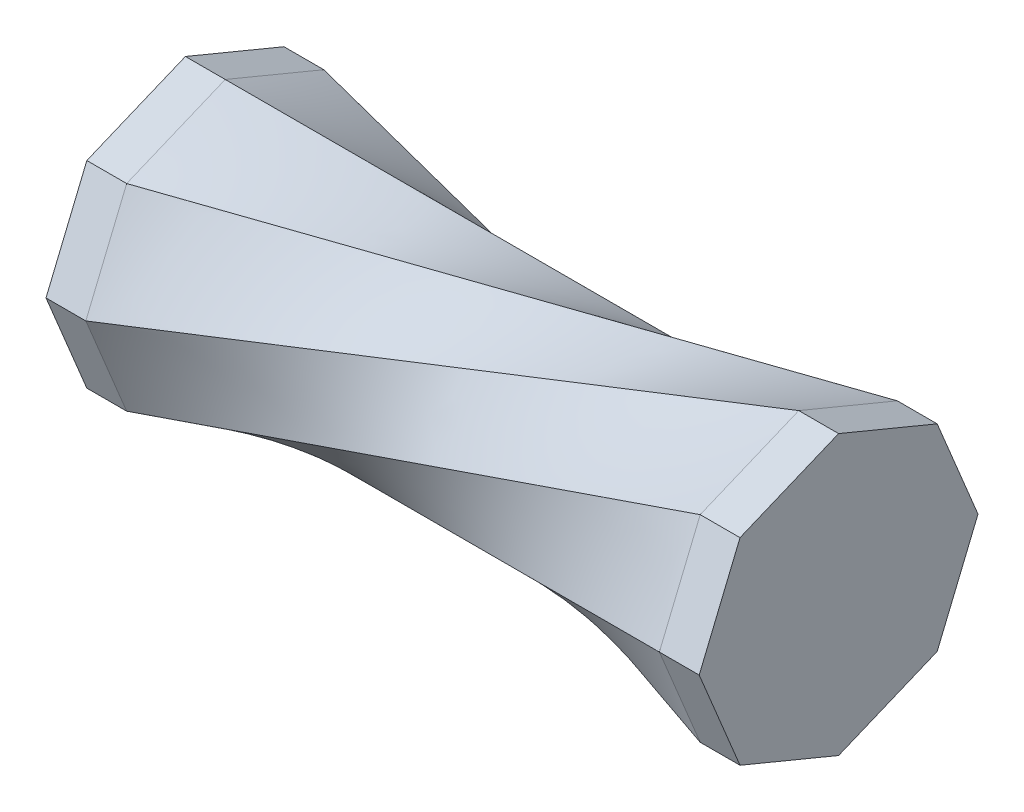
ISO-10303-21;
HEADER;
FILE_DESCRIPTION(('STEP AP214'),'2;1');
FILE_NAME('part.step','',(''),(''),'','','');
FILE_SCHEMA(('AUTOMOTIVE_DESIGN { 1 0 10303 214 1 1 1 1 }'));
ENDSEC;
DATA;
#1=APPLICATION_CONTEXT('core data for automotive mechanical design processes');
#2=APPLICATION_PROTOCOL_DEFINITION('international standard','automotive_design',2000,#1);
#3=PRODUCT_CONTEXT('',#1,'mechanical');
#4=PRODUCT('Part','Part','',(#3));
#5=PRODUCT_RELATED_PRODUCT_CATEGORY('part','',(#4));
#6=PRODUCT_DEFINITION_FORMATION('','',#4);
#7=PRODUCT_DEFINITION_CONTEXT('part definition',#1,'design');
#8=PRODUCT_DEFINITION('design','',#6,#7);
#9=PRODUCT_DEFINITION_SHAPE('','',#8);
#10=(LENGTH_UNIT() NAMED_UNIT(*) SI_UNIT(.MILLI.,.METRE.));
#11=(NAMED_UNIT(*) PLANE_ANGLE_UNIT() SI_UNIT($,.RADIAN.));
#12=(NAMED_UNIT(*) SI_UNIT($,.STERADIAN.) SOLID_ANGLE_UNIT());
#13=UNCERTAINTY_MEASURE_WITH_UNIT(LENGTH_MEASURE(1.E-05),#10,'distance_accuracy_value','');
#14=(GEOMETRIC_REPRESENTATION_CONTEXT(3) GLOBAL_UNCERTAINTY_ASSIGNED_CONTEXT((#13)) GLOBAL_UNIT_ASSIGNED_CONTEXT((#10,
#11,#12)) REPRESENTATION_CONTEXT('',''));
#15=CARTESIAN_POINT('',(0.,0.,0.));
#16=DIRECTION('',(0.,0.,1.));
#17=DIRECTION('',(1.,0.,0.));
#18=AXIS2_PLACEMENT_3D('',#15,#16,#17);
#19=CARTESIAN_POINT('',(0.,-8.75,0.));
#20=CARTESIAN_POINT('',(36.,0.,8.75));
#21=CARTESIAN_POINT('',(0.,-8.32286405589705,1.03119738923046));
#22=CARTESIAN_POINT('',(36.,1.03119738923038,8.32286405589705));
#23=CARTESIAN_POINT('',(0.,-7.8957281117941,2.06239477846083));
#24=CARTESIAN_POINT('',(36.,2.06239477846076,7.8957281117941));
#25=CARTESIAN_POINT('',(0.,-7.0414562235882,4.12478955692156));
#26=CARTESIAN_POINT('',(36.,4.12478955692152,7.0414562235882));
#27=CARTESIAN_POINT('',(0.,-6.61432027948524,5.15598694615192));
#28=CARTESIAN_POINT('',(36.,5.1559869461519,6.61432027948525));
#29=CARTESIAN_POINT('',(0.,-6.18718433538229,6.18718433538229));
#30=CARTESIAN_POINT('',(36.,6.18718433538228,6.1871843353823));
#31=B_SPLINE_SURFACE_WITH_KNOTS('',3,1,((#19,#20),(#21,#22),(#23,#24),(#25,#26),(#27,#28),(#29,
#30)),.UNSPECIFIED.,.F.,.F.,.F.,(4,2,4),(2,2),(0.,0.5,1.),(0.,1.),.UNSPECIFIED.);
#32=CARTESIAN_POINT('',(0.,-6.18718433538229,6.18718433538229));
#33=CARTESIAN_POINT('',(0.,-6.61432027948524,5.15598694615192));
#34=CARTESIAN_POINT('',(0.,-7.0414562235882,4.12478955692156));
#35=CARTESIAN_POINT('',(0.,-7.8957281117941,2.06239477846083));
#36=CARTESIAN_POINT('',(0.,-8.32286405589705,1.03119738923046));
#37=CARTESIAN_POINT('',(0.,-8.75,0.));
#38=B_SPLINE_CURVE_WITH_KNOTS('',3,(#32,#33,#34,#35,#36,#37),.UNSPECIFIED.,.F.,.F.,(4,2,4),(0.,
0.5,1.),.UNSPECIFIED.);
#39=CARTESIAN_POINT('',(0.,-8.75,0.));
#40=VERTEX_POINT('',#39);
#41=CARTESIAN_POINT('',(0.,-6.18718433538229,6.18718433538229));
#42=VERTEX_POINT('',#41);
#43=EDGE_CURVE('E408',#40,#42,#38,.F.);
#44=DIRECTION('',(-0.945691697661905,-0.229855620959491,-0.229855620959488));
#45=VECTOR('',#44,1.);
#46=CARTESIAN_POINT('',(18.,-4.375,4.37500000000005));
#47=LINE('',#46,#45);
#48=CARTESIAN_POINT('',(36.,0.,8.75));
#49=VERTEX_POINT('',#48);
#50=EDGE_CURVE('E392',#49,#40,#47,.T.);
#51=CARTESIAN_POINT('',(36.,0.,8.75));
#52=CARTESIAN_POINT('',(36.,1.03119738923038,8.32286405589705));
#53=CARTESIAN_POINT('',(36.,2.06239477846076,7.8957281117941));
#54=CARTESIAN_POINT('',(36.,4.12478955692152,7.0414562235882));
#55=CARTESIAN_POINT('',(36.,5.1559869461519,6.61432027948525));
#56=CARTESIAN_POINT('',(36.,6.18718433538228,6.1871843353823));
#57=B_SPLINE_CURVE_WITH_KNOTS('',3,(#51,#52,#53,#54,#55,#56),.UNSPECIFIED.,.F.,.F.,(4,2,4),(0.,
0.5,1.),.UNSPECIFIED.);
#58=CARTESIAN_POINT('',(36.,6.18718433538229,6.1871843353823));
#59=VERTEX_POINT('',#58);
#60=EDGE_CURVE('E11',#49,#59,#57,.T.);
#61=DIRECTION('',(0.945691697661904,0.325064936548601,0.));
#62=VECTOR('',#61,1.);
#63=CARTESIAN_POINT('',(18.,0.,6.18718433538229));
#64=LINE('',#63,#62);
#65=EDGE_CURVE('E399',#42,#59,#64,.T.);
#66=ORIENTED_EDGE('',*,*,#43,.F.);
#67=ORIENTED_EDGE('',*,*,#50,.F.);
#68=ORIENTED_EDGE('',*,*,#60,.T.);
#69=ORIENTED_EDGE('',*,*,#65,.F.);
#70=EDGE_LOOP('',(#66,#67,#68,#69));
#71=FACE_BOUND('',#70,.T.);
#72=ADVANCED_FACE('F43',(#71),#31,.F.);
#73=CARTESIAN_POINT('',(0.,-6.18718433538229,6.18718433538229));
#74=CARTESIAN_POINT('',(36.,6.18718433538229,6.1871843353823));
#75=CARTESIAN_POINT('',(0.,-5.1559869461519,6.61432027948525));
#76=CARTESIAN_POINT('',(36.,6.61432027948524,5.15598694615192));
#77=CARTESIAN_POINT('',(0.,-4.12478955692151,7.0414562235882));
#78=CARTESIAN_POINT('',(36.,7.04145622358819,4.12478955692153));
#79=CARTESIAN_POINT('',(0.,-2.06239477846075,7.89572811179411));
#80=CARTESIAN_POINT('',(36.,7.89572811179409,2.06239477846076));
#81=CARTESIAN_POINT('',(0.,-1.03119738923037,8.32286405589706));
#82=CARTESIAN_POINT('',(36.,8.32286405589704,1.03119738923038));
#83=CARTESIAN_POINT('',(0.,0.,8.75));
#84=CARTESIAN_POINT('',(36.,8.75,0.));
#85=B_SPLINE_SURFACE_WITH_KNOTS('',3,1,((#73,#74),(#75,#76),(#77,#78),(#79,#80),(#81,#82),(#83,
#84)),.UNSPECIFIED.,.F.,.F.,.F.,(4,2,4),(2,2),(0.,0.5,1.),(0.,1.),.UNSPECIFIED.);
#86=CARTESIAN_POINT('',(0.,0.,8.75));
#87=CARTESIAN_POINT('',(0.,-1.03119738923037,8.32286405589706));
#88=CARTESIAN_POINT('',(0.,-2.06239477846075,7.89572811179411));
#89=CARTESIAN_POINT('',(0.,-4.12478955692151,7.0414562235882));
#90=CARTESIAN_POINT('',(0.,-5.1559869461519,6.61432027948525));
#91=CARTESIAN_POINT('',(0.,-6.18718433538229,6.18718433538229));
#92=B_SPLINE_CURVE_WITH_KNOTS('',3,(#86,#87,#88,#89,#90,#91),.UNSPECIFIED.,.F.,.F.,(4,2,4),(0.,
0.5,1.),.UNSPECIFIED.);
#93=CARTESIAN_POINT('',(0.,0.,8.75));
#94=VERTEX_POINT('',#93);
#95=EDGE_CURVE('E584',#42,#94,#92,.F.);
#96=CARTESIAN_POINT('',(36.,6.18718433538229,6.1871843353823));
#97=CARTESIAN_POINT('',(36.,6.61432027948524,5.15598694615192));
#98=CARTESIAN_POINT('',(36.,7.04145622358819,4.12478955692153));
#99=CARTESIAN_POINT('',(36.,7.89572811179409,2.06239477846076));
#100=CARTESIAN_POINT('',(36.,8.32286405589704,1.03119738923038));
#101=CARTESIAN_POINT('',(36.,8.75,0.));
#102=B_SPLINE_CURVE_WITH_KNOTS('',3,(#96,#97,#98,#99,#100,#101),.UNSPECIFIED.,.F.,.F.,(4,2,4),
(0.,0.5,1.),.UNSPECIFIED.);
#103=CARTESIAN_POINT('',(36.,8.75,0.));
#104=VERTEX_POINT('',#103);
#105=EDGE_CURVE('E179',#59,#104,#102,.T.);
#106=DIRECTION('',(0.945691697661904,0.22985562095949,-0.229855620959491));
#107=VECTOR('',#106,1.);
#108=CARTESIAN_POINT('',(18.,4.375,4.375));
#109=LINE('',#108,#107);
#110=EDGE_CURVE('E238',#94,#104,#109,.T.);
#111=ORIENTED_EDGE('',*,*,#95,.F.);
#112=ORIENTED_EDGE('',*,*,#65,.T.);
#113=ORIENTED_EDGE('',*,*,#105,.T.);
#114=ORIENTED_EDGE('',*,*,#110,.F.);
#115=EDGE_LOOP('',(#111,#112,#113,#114));
#116=FACE_BOUND('',#115,.T.);
#117=ADVANCED_FACE('F424',(#116),#85,.F.);
#118=CARTESIAN_POINT('',(0.,-6.18718433538229,-6.18718433538229));
#119=CARTESIAN_POINT('',(36.,-6.18718433538229,6.18718433538229));
#120=CARTESIAN_POINT('',(0.,-6.61432027948524,-5.15598694615189));
#121=CARTESIAN_POINT('',(36.,-5.15598694615191,6.61432027948524));
#122=CARTESIAN_POINT('',(0.,-7.04145622358819,-4.12478955692149));
#123=CARTESIAN_POINT('',(36.,-4.12478955692153,7.0414562235882));
#124=CARTESIAN_POINT('',(0.,-7.8957281117941,-2.06239477846069));
#125=CARTESIAN_POINT('',(36.,-2.06239477846077,7.8957281117941));
#126=CARTESIAN_POINT('',(0.,-8.32286405589705,-1.0311973892303));
#127=CARTESIAN_POINT('',(36.,-1.03119738923038,8.32286405589705));
#128=CARTESIAN_POINT('',(0.,-8.75,0.));
#129=CARTESIAN_POINT('',(36.,0.,8.75));
#130=B_SPLINE_SURFACE_WITH_KNOTS('',3,1,((#118,#119),(#120,#121),(#122,#123),(#124,#125),(#126,
#127),(#128,#129)),.UNSPECIFIED.,.F.,.F.,.F.,(4,2,4),(2,2),(0.,0.5,1.),(0.,1.),.UNSPECIFIED.);
#131=CARTESIAN_POINT('',(0.,-8.75,0.));
#132=CARTESIAN_POINT('',(0.,-8.32286405589705,-1.0311973892303));
#133=CARTESIAN_POINT('',(0.,-7.8957281117941,-2.06239477846069));
#134=CARTESIAN_POINT('',(0.,-7.04145622358819,-4.12478955692149));
#135=CARTESIAN_POINT('',(0.,-6.61432027948524,-5.15598694615189));
#136=CARTESIAN_POINT('',(0.,-6.18718433538229,-6.18718433538229));
#137=B_SPLINE_CURVE_WITH_KNOTS('',3,(#131,#132,#133,#134,#135,#136),.UNSPECIFIED.,.F.,.F.,(4,2,
4),(0.,0.5,1.),.UNSPECIFIED.);
#138=CARTESIAN_POINT('',(0.,-6.18718433538229,-6.18718433538229));
#139=VERTEX_POINT('',#138);
#140=EDGE_CURVE('E388',#139,#40,#137,.F.);
#141=DIRECTION('',(0.945691697661904,0.,0.325064936548601));
#142=VECTOR('',#141,1.);
#143=CARTESIAN_POINT('',(18.,-6.18718433538229,0.));
#144=LINE('',#143,#142);
#145=CARTESIAN_POINT('',(36.,-6.18718433538229,6.18718433538229));
#146=VERTEX_POINT('',#145);
#147=EDGE_CURVE('E362',#139,#146,#144,.T.);
#148=CARTESIAN_POINT('',(36.,-6.18718433538229,6.18718433538229));
#149=CARTESIAN_POINT('',(36.,-5.15598694615191,6.61432027948524));
#150=CARTESIAN_POINT('',(36.,-4.12478955692153,7.0414562235882));
#151=CARTESIAN_POINT('',(36.,-2.06239477846077,7.8957281117941));
#152=CARTESIAN_POINT('',(36.,-1.03119738923038,8.32286405589705));
#153=CARTESIAN_POINT('',(36.,0.,8.75));
#154=B_SPLINE_CURVE_WITH_KNOTS('',3,(#148,#149,#150,#151,#152,#153),.UNSPECIFIED.,.F.,.F.,(4,2,
4),(0.,0.5,1.),.UNSPECIFIED.);
#155=EDGE_CURVE('E57',#146,#49,#154,.T.);
#156=ORIENTED_EDGE('',*,*,#140,.F.);
#157=ORIENTED_EDGE('',*,*,#147,.T.);
#158=ORIENTED_EDGE('',*,*,#155,.T.);
#159=ORIENTED_EDGE('',*,*,#50,.T.);
#160=EDGE_LOOP('',(#156,#157,#158,#159));
#161=FACE_BOUND('',#160,.T.);
#162=ADVANCED_FACE('F253',(#161),#130,.F.);
#163=CARTESIAN_POINT('',(0.,0.,8.75));
#164=CARTESIAN_POINT('',(36.,8.75,0.));
#165=CARTESIAN_POINT('',(0.,1.03119738923038,8.32286405589705));
#166=CARTESIAN_POINT('',(36.,8.32286405589704,-1.03119738923039));
#167=CARTESIAN_POINT('',(0.,2.06239477846076,7.8957281117941));
#168=CARTESIAN_POINT('',(36.,7.89572811179409,-2.06239477846077));
#169=CARTESIAN_POINT('',(0.,4.12478955692152,7.0414562235882));
#170=CARTESIAN_POINT('',(36.,7.04145622358819,-4.12478955692153));
#171=CARTESIAN_POINT('',(0.,5.1559869461519,6.61432027948525));
#172=CARTESIAN_POINT('',(36.,6.61432027948524,-5.15598694615191));
#173=CARTESIAN_POINT('',(0.,6.18718433538228,6.1871843353823));
#174=CARTESIAN_POINT('',(36.,6.18718433538229,-6.18718433538229));
#175=B_SPLINE_SURFACE_WITH_KNOTS('',3,1,((#163,#164),(#165,#166),(#167,#168),(#169,#170),(#171,
#172),(#173,#174)),.UNSPECIFIED.,.F.,.F.,.F.,(4,2,4),(2,2),(0.,0.5,1.),(0.,1.),.UNSPECIFIED.);
#176=CARTESIAN_POINT('',(0.,6.18718433538228,6.1871843353823));
#177=CARTESIAN_POINT('',(0.,5.1559869461519,6.61432027948525));
#178=CARTESIAN_POINT('',(0.,4.12478955692152,7.0414562235882));
#179=CARTESIAN_POINT('',(0.,2.06239477846076,7.8957281117941));
#180=CARTESIAN_POINT('',(0.,1.03119738923038,8.32286405589705));
#181=CARTESIAN_POINT('',(0.,0.,8.75));
#182=B_SPLINE_CURVE_WITH_KNOTS('',3,(#176,#177,#178,#179,#180,#181),.UNSPECIFIED.,.F.,.F.,(4,2,
4),(0.,0.5,1.),.UNSPECIFIED.);
#183=CARTESIAN_POINT('',(0.,6.18718433538229,6.1871843353823));
#184=VERTEX_POINT('',#183);
#185=EDGE_CURVE('E232',#94,#184,#182,.F.);
#186=CARTESIAN_POINT('',(36.,8.75,0.));
#187=CARTESIAN_POINT('',(36.,8.32286405589704,-1.03119738923039));
#188=CARTESIAN_POINT('',(36.,7.89572811179409,-2.06239477846077));
#189=CARTESIAN_POINT('',(36.,7.04145622358819,-4.12478955692153));
#190=CARTESIAN_POINT('',(36.,6.61432027948524,-5.15598694615191));
#191=CARTESIAN_POINT('',(36.,6.18718433538229,-6.18718433538229));
#192=B_SPLINE_CURVE_WITH_KNOTS('',3,(#186,#187,#188,#189,#190,#191),.UNSPECIFIED.,.F.,.F.,(4,2,
4),(0.,0.5,1.),.UNSPECIFIED.);
#193=CARTESIAN_POINT('',(36.,6.18718433538229,-6.18718433538229));
#194=VERTEX_POINT('',#193);
#195=EDGE_CURVE('E458',#104,#194,#192,.T.);
#196=DIRECTION('',(0.945691697661904,0.,-0.325064936548601));
#197=VECTOR('',#196,1.);
#198=CARTESIAN_POINT('',(18.,6.18718433538229,0.));
#199=LINE('',#198,#197);
#200=EDGE_CURVE('E649',#184,#194,#199,.T.);
#201=ORIENTED_EDGE('',*,*,#185,.F.);
#202=ORIENTED_EDGE('',*,*,#110,.T.);
#203=ORIENTED_EDGE('',*,*,#195,.T.);
#204=ORIENTED_EDGE('',*,*,#200,.F.);
#205=EDGE_LOOP('',(#201,#202,#203,#204));
#206=FACE_BOUND('',#205,.T.);
#207=ADVANCED_FACE('F240',(#206),#175,.F.);
#208=CARTESIAN_POINT('',(0.,6.18718433538229,6.1871843353823));
#209=CARTESIAN_POINT('',(36.,6.18718433538229,-6.18718433538229));
#210=CARTESIAN_POINT('',(0.,6.61432027948524,5.15598694615192));
#211=CARTESIAN_POINT('',(36.,5.15598694615192,-6.61432027948524));
#212=CARTESIAN_POINT('',(0.,7.04145622358819,4.12478955692154));
#213=CARTESIAN_POINT('',(36.,4.12478955692154,-7.04145622358819));
#214=CARTESIAN_POINT('',(0.,7.89572811179409,2.06239477846077));
#215=CARTESIAN_POINT('',(36.,2.06239477846078,-7.89572811179409));
#216=CARTESIAN_POINT('',(0.,8.32286405589704,1.03119738923038));
#217=CARTESIAN_POINT('',(36.,1.03119738923039,-8.32286405589704));
#218=CARTESIAN_POINT('',(0.,8.75,0.));
#219=CARTESIAN_POINT('',(36.,0.,-8.75));
#220=B_SPLINE_SURFACE_WITH_KNOTS('',3,1,((#208,#209),(#210,#211),(#212,#213),(#214,#215),(#216,
#217),(#218,#219)),.UNSPECIFIED.,.F.,.F.,.F.,(4,2,4),(2,2),(0.,0.5,1.),(0.,1.),.UNSPECIFIED.);
#221=CARTESIAN_POINT('',(0.,8.75,0.));
#222=CARTESIAN_POINT('',(0.,8.32286405589704,1.03119738923038));
#223=CARTESIAN_POINT('',(0.,7.89572811179409,2.06239477846077));
#224=CARTESIAN_POINT('',(0.,7.04145622358819,4.12478955692154));
#225=CARTESIAN_POINT('',(0.,6.61432027948524,5.15598694615192));
#226=CARTESIAN_POINT('',(0.,6.18718433538229,6.1871843353823));
#227=B_SPLINE_CURVE_WITH_KNOTS('',3,(#221,#222,#223,#224,#225,#226),.UNSPECIFIED.,.F.,.F.,(4,2,
4),(0.,0.5,1.),.UNSPECIFIED.);
#228=CARTESIAN_POINT('',(0.,8.75,0.));
#229=VERTEX_POINT('',#228);
#230=EDGE_CURVE('E620',#184,#229,#227,.F.);
#231=CARTESIAN_POINT('',(36.,6.18718433538229,-6.18718433538229));
#232=CARTESIAN_POINT('',(36.,5.15598694615192,-6.61432027948524));
#233=CARTESIAN_POINT('',(36.,4.12478955692154,-7.04145622358819));
#234=CARTESIAN_POINT('',(36.,2.06239477846078,-7.89572811179409));
#235=CARTESIAN_POINT('',(36.,1.03119738923039,-8.32286405589704));
#236=CARTESIAN_POINT('',(36.,0.,-8.75));
#237=B_SPLINE_CURVE_WITH_KNOTS('',3,(#231,#232,#233,#234,#235,#236),.UNSPECIFIED.,.F.,.F.,(4,2,
4),(0.,0.5,1.),.UNSPECIFIED.);
#238=CARTESIAN_POINT('',(36.,0.,-8.75));
#239=VERTEX_POINT('',#238);
#240=EDGE_CURVE('E286',#194,#239,#237,.T.);
#241=DIRECTION('',(0.945691697661904,-0.229855620959491,-0.22985562095949));
#242=VECTOR('',#241,1.);
#243=CARTESIAN_POINT('',(18.,4.375,-4.375));
#244=LINE('',#243,#242);
#245=EDGE_CURVE('E343',#229,#239,#244,.T.);
#246=ORIENTED_EDGE('',*,*,#230,.F.);
#247=ORIENTED_EDGE('',*,*,#200,.T.);
#248=ORIENTED_EDGE('',*,*,#240,.T.);
#249=ORIENTED_EDGE('',*,*,#245,.F.);
#250=EDGE_LOOP('',(#246,#247,#248,#249));
#251=FACE_BOUND('',#250,.T.);
#252=ADVANCED_FACE('F252',(#251),#220,.F.);
#253=CARTESIAN_POINT('',(0.,8.75,0.));
#254=CARTESIAN_POINT('',(36.,0.,-8.75));
#255=CARTESIAN_POINT('',(0.,8.32286405589705,-1.03119738923038));
#256=CARTESIAN_POINT('',(36.,-1.03119738923038,-8.32286405589705));
#257=CARTESIAN_POINT('',(0.,7.89572811179409,-2.06239477846076));
#258=CARTESIAN_POINT('',(36.,-2.06239477846076,-7.8957281117941));
#259=CARTESIAN_POINT('',(0.,7.04145622358819,-4.12478955692153));
#260=CARTESIAN_POINT('',(36.,-4.12478955692152,-7.04145622358819));
#261=CARTESIAN_POINT('',(0.,6.61432027948524,-5.15598694615191));
#262=CARTESIAN_POINT('',(36.,-5.15598694615191,-6.61432027948524));
#263=CARTESIAN_POINT('',(0.,6.18718433538229,-6.18718433538229));
#264=CARTESIAN_POINT('',(36.,-6.18718433538229,-6.18718433538229));
#265=B_SPLINE_SURFACE_WITH_KNOTS('',3,1,((#253,#254),(#255,#256),(#257,#258),(#259,#260),(#261,
#262),(#263,#264)),.UNSPECIFIED.,.F.,.F.,.F.,(4,2,4),(2,2),(0.,0.5,1.),(0.,1.),.UNSPECIFIED.);
#266=CARTESIAN_POINT('',(0.,6.18718433538229,-6.18718433538229));
#267=CARTESIAN_POINT('',(0.,6.61432027948524,-5.15598694615191));
#268=CARTESIAN_POINT('',(0.,7.04145622358819,-4.12478955692153));
#269=CARTESIAN_POINT('',(0.,7.89572811179409,-2.06239477846076));
#270=CARTESIAN_POINT('',(0.,8.32286405589705,-1.03119738923038));
#271=CARTESIAN_POINT('',(0.,8.75,0.));
#272=B_SPLINE_CURVE_WITH_KNOTS('',3,(#266,#267,#268,#269,#270,#271),.UNSPECIFIED.,.F.,.F.,(4,2,
4),(0.,0.5,1.),.UNSPECIFIED.);
#273=CARTESIAN_POINT('',(0.,6.18718433538229,-6.18718433538229));
#274=VERTEX_POINT('',#273);
#275=EDGE_CURVE('E625',#229,#274,#272,.F.);
#276=CARTESIAN_POINT('',(36.,0.,-8.75));
#277=CARTESIAN_POINT('',(36.,-1.03119738923038,-8.32286405589705));
#278=CARTESIAN_POINT('',(36.,-2.06239477846076,-7.8957281117941));
#279=CARTESIAN_POINT('',(36.,-4.12478955692152,-7.04145622358819));
#280=CARTESIAN_POINT('',(36.,-5.15598694615191,-6.61432027948524));
#281=CARTESIAN_POINT('',(36.,-6.18718433538229,-6.18718433538229));
#282=B_SPLINE_CURVE_WITH_KNOTS('',3,(#276,#277,#278,#279,#280,#281),.UNSPECIFIED.,.F.,.F.,(4,2,
4),(0.,0.5,1.),.UNSPECIFIED.);
#283=CARTESIAN_POINT('',(36.,-6.18718433538229,-6.18718433538229));
#284=VERTEX_POINT('',#283);
#285=EDGE_CURVE('E301',#239,#284,#282,.T.);
#286=DIRECTION('',(0.945691697661904,-0.325064936548601,0.));
#287=VECTOR('',#286,1.);
#288=CARTESIAN_POINT('',(18.,0.,-6.18718433538229));
#289=LINE('',#288,#287);
#290=EDGE_CURVE('E334',#274,#284,#289,.T.);
#291=ORIENTED_EDGE('',*,*,#275,.F.);
#292=ORIENTED_EDGE('',*,*,#245,.T.);
#293=ORIENTED_EDGE('',*,*,#285,.T.);
#294=ORIENTED_EDGE('',*,*,#290,.F.);
#295=EDGE_LOOP('',(#291,#292,#293,#294));
#296=FACE_BOUND('',#295,.T.);
#297=ADVANCED_FACE('F307',(#296),#265,.F.);
#298=CARTESIAN_POINT('',(0.,6.18718433538229,-6.18718433538229));
#299=CARTESIAN_POINT('',(36.,-6.18718433538229,-6.18718433538229));
#300=CARTESIAN_POINT('',(0.,5.15598694615191,-6.61432027948524));
#301=CARTESIAN_POINT('',(36.,-6.61432027948525,-5.15598694615188));
#302=CARTESIAN_POINT('',(0.,4.12478955692153,-7.04145622358819));
#303=CARTESIAN_POINT('',(36.,-7.0414562235882,-4.12478955692147));
#304=CARTESIAN_POINT('',(0.,2.06239477846076,-7.8957281117941));
#305=CARTESIAN_POINT('',(36.,-7.89572811179411,-2.06239477846067));
#306=CARTESIAN_POINT('',(0.,1.03119738923038,-8.32286405589705));
#307=CARTESIAN_POINT('',(36.,-8.32286405589705,-1.03119738923028));
#308=CARTESIAN_POINT('',(0.,0.,-8.75));
#309=CARTESIAN_POINT('',(36.,-8.75,0.));
#310=B_SPLINE_SURFACE_WITH_KNOTS('',3,1,((#298,#299),(#300,#301),(#302,#303),(#304,#305),(#306,
#307),(#308,#309)),.UNSPECIFIED.,.F.,.F.,.F.,(4,2,4),(2,2),(0.,0.5,1.),(0.,1.),.UNSPECIFIED.);
#311=CARTESIAN_POINT('',(0.,0.,-8.75));
#312=CARTESIAN_POINT('',(0.,1.03119738923038,-8.32286405589705));
#313=CARTESIAN_POINT('',(0.,2.06239477846076,-7.8957281117941));
#314=CARTESIAN_POINT('',(0.,4.12478955692153,-7.04145622358819));
#315=CARTESIAN_POINT('',(0.,5.15598694615191,-6.61432027948524));
#316=CARTESIAN_POINT('',(0.,6.18718433538229,-6.18718433538229));
#317=B_SPLINE_CURVE_WITH_KNOTS('',3,(#311,#312,#313,#314,#315,#316),.UNSPECIFIED.,.F.,.F.,(4,2,
4),(0.,0.5,1.),.UNSPECIFIED.);
#318=CARTESIAN_POINT('',(0.,0.,-8.75));
#319=VERTEX_POINT('',#318);
#320=EDGE_CURVE('E351',#274,#319,#317,.F.);
#321=CARTESIAN_POINT('',(36.,-6.18718433538229,-6.18718433538229));
#322=CARTESIAN_POINT('',(36.,-6.61432027948525,-5.15598694615188));
#323=CARTESIAN_POINT('',(36.,-7.0414562235882,-4.12478955692147));
#324=CARTESIAN_POINT('',(36.,-7.89572811179411,-2.06239477846067));
#325=CARTESIAN_POINT('',(36.,-8.32286405589705,-1.03119738923028));
#326=CARTESIAN_POINT('',(36.,-8.75,0.));
#327=B_SPLINE_CURVE_WITH_KNOTS('',3,(#321,#322,#323,#324,#325,#326),.UNSPECIFIED.,.F.,.F.,(4,2,
4),(0.,0.5,1.),.UNSPECIFIED.);
#328=CARTESIAN_POINT('',(36.,-8.75,0.));
#329=VERTEX_POINT('',#328);
#330=EDGE_CURVE('E460',#284,#329,#327,.T.);
#331=DIRECTION('',(0.945691697661904,-0.22985562095949,0.229855620959493));
#332=VECTOR('',#331,1.);
#333=CARTESIAN_POINT('',(18.,-4.375,-4.37499999999995));
#334=LINE('',#333,#332);
#335=EDGE_CURVE('E342',#319,#329,#334,.T.);
#336=ORIENTED_EDGE('',*,*,#320,.F.);
#337=ORIENTED_EDGE('',*,*,#290,.T.);
#338=ORIENTED_EDGE('',*,*,#330,.T.);
#339=ORIENTED_EDGE('',*,*,#335,.F.);
#340=EDGE_LOOP('',(#336,#337,#338,#339));
#341=FACE_BOUND('',#340,.T.);
#342=ADVANCED_FACE('F317',(#341),#310,.F.);
#343=CARTESIAN_POINT('',(0.,0.,-8.75));
#344=CARTESIAN_POINT('',(36.,-8.75,0.));
#345=CARTESIAN_POINT('',(0.,-1.03119738923038,-8.32286405589705));
#346=CARTESIAN_POINT('',(36.,-8.32286405589705,1.03119738923046));
#347=CARTESIAN_POINT('',(0.,-2.06239477846077,-7.8957281117941));
#348=CARTESIAN_POINT('',(36.,-7.8957281117941,2.06239477846083));
#349=CARTESIAN_POINT('',(0.,-4.12478955692153,-7.04145622358819));
#350=CARTESIAN_POINT('',(36.,-7.0414562235882,4.12478955692156));
#351=CARTESIAN_POINT('',(0.,-5.15598694615191,-6.61432027948524));
#352=CARTESIAN_POINT('',(36.,-6.61432027948524,5.15598694615192));
#353=CARTESIAN_POINT('',(0.,-6.18718433538229,-6.18718433538229));
#354=CARTESIAN_POINT('',(36.,-6.18718433538229,6.18718433538229));
#355=B_SPLINE_SURFACE_WITH_KNOTS('',3,1,((#343,#344),(#345,#346),(#347,#348),(#349,#350),(#351,
#352),(#353,#354)),.UNSPECIFIED.,.F.,.F.,.F.,(4,2,4),(2,2),(0.,0.5,1.),(0.,1.),.UNSPECIFIED.);
#356=CARTESIAN_POINT('',(0.,-6.18718433538229,-6.18718433538229));
#357=CARTESIAN_POINT('',(0.,-5.15598694615191,-6.61432027948524));
#358=CARTESIAN_POINT('',(0.,-4.12478955692153,-7.04145622358819));
#359=CARTESIAN_POINT('',(0.,-2.06239477846077,-7.8957281117941));
#360=CARTESIAN_POINT('',(0.,-1.03119738923038,-8.32286405589705));
#361=CARTESIAN_POINT('',(0.,0.,-8.75));
#362=B_SPLINE_CURVE_WITH_KNOTS('',3,(#356,#357,#358,#359,#360,#361),.UNSPECIFIED.,.F.,.F.,(4,2,
4),(0.,0.5,1.),.UNSPECIFIED.);
#363=EDGE_CURVE('E370',#319,#139,#362,.F.);
#364=CARTESIAN_POINT('',(36.,-8.75,0.));
#365=CARTESIAN_POINT('',(36.,-8.32286405589705,1.03119738923046));
#366=CARTESIAN_POINT('',(36.,-7.8957281117941,2.06239477846083));
#367=CARTESIAN_POINT('',(36.,-7.0414562235882,4.12478955692156));
#368=CARTESIAN_POINT('',(36.,-6.61432027948524,5.15598694615192));
#369=CARTESIAN_POINT('',(36.,-6.18718433538229,6.18718433538229));
#370=B_SPLINE_CURVE_WITH_KNOTS('',3,(#364,#365,#366,#367,#368,#369),.UNSPECIFIED.,.F.,.F.,(4,2,
4),(0.,0.5,1.),.UNSPECIFIED.);
#371=EDGE_CURVE('E461',#329,#146,#370,.T.);
#372=ORIENTED_EDGE('',*,*,#363,.F.);
#373=ORIENTED_EDGE('',*,*,#335,.T.);
#374=ORIENTED_EDGE('',*,*,#371,.T.);
#375=ORIENTED_EDGE('',*,*,#147,.F.);
#376=EDGE_LOOP('',(#372,#373,#374,#375));
#377=FACE_BOUND('',#376,.T.);
#378=ADVANCED_FACE('F45',(#377),#355,.F.);
#379=CARTESIAN_POINT('',(-2.5,6.18718433538229,-6.18718433538229));
#380=DIRECTION('',(0.,-0.923879532511287,0.38268343236509));
#381=DIRECTION('',(0.,0.38268343236509,0.923879532511287));
#382=AXIS2_PLACEMENT_3D('',#379,#380,#381);
#383=PLANE('',#382);
#384=ORIENTED_EDGE('',*,*,#275,.T.);
#385=DIRECTION('',(1.,0.,0.));
#386=VECTOR('',#385,1.);
#387=CARTESIAN_POINT('',(-2.5,6.18718433538229,-6.18718433538229));
#388=LINE('',#387,#386);
#389=CARTESIAN_POINT('',(-2.5,6.18718433538229,-6.18718433538229));
#390=VERTEX_POINT('',#389);
#391=EDGE_CURVE('E225',#390,#274,#388,.T.);
#392=ORIENTED_EDGE('',*,*,#391,.F.);
#393=DIRECTION('',(0.,0.38268343236509,0.923879532511287));
#394=VECTOR('',#393,1.);
#395=CARTESIAN_POINT('',(-2.5,6.18718433538229,-6.18718433538229));
#396=LINE('',#395,#394);
#397=CARTESIAN_POINT('',(-2.5,8.75,0.));
#398=VERTEX_POINT('',#397);
#399=EDGE_CURVE('E183',#390,#398,#396,.T.);
#400=ORIENTED_EDGE('',*,*,#399,.T.);
#401=DIRECTION('',(1.,0.,0.));
#402=VECTOR('',#401,1.);
#403=CARTESIAN_POINT('',(-2.5,8.75,0.));
#404=LINE('',#403,#402);
#405=EDGE_CURVE('E616',#398,#229,#404,.T.);
#406=ORIENTED_EDGE('',*,*,#405,.T.);
#407=EDGE_LOOP('',(#384,#392,#400,#406));
#408=FACE_BOUND('',#407,.T.);
#409=ADVANCED_FACE('F425',(#408),#383,.F.);
#410=CARTESIAN_POINT('',(-2.5,8.75,0.));
#411=DIRECTION('',(0.,-0.923879532511287,-0.38268343236509));
#412=DIRECTION('',(0.,-0.38268343236509,0.923879532511287));
#413=AXIS2_PLACEMENT_3D('',#410,#411,#412);
#414=PLANE('',#413);
#415=ORIENTED_EDGE('',*,*,#230,.T.);
#416=ORIENTED_EDGE('',*,*,#405,.F.);
#417=DIRECTION('',(0.,-0.38268343236509,0.923879532511287));
#418=VECTOR('',#417,1.);
#419=CARTESIAN_POINT('',(-2.5,8.75,0.));
#420=LINE('',#419,#418);
#421=CARTESIAN_POINT('',(-2.5,6.18718433538229,6.1871843353823));
#422=VERTEX_POINT('',#421);
#423=EDGE_CURVE('E205',#398,#422,#420,.T.);
#424=ORIENTED_EDGE('',*,*,#423,.T.);
#425=DIRECTION('',(1.,0.,0.));
#426=VECTOR('',#425,1.);
#427=CARTESIAN_POINT('',(-2.5,6.18718433538229,6.1871843353823));
#428=LINE('',#427,#426);
#429=EDGE_CURVE('E570',#422,#184,#428,.T.);
#430=ORIENTED_EDGE('',*,*,#429,.T.);
#431=EDGE_LOOP('',(#415,#416,#424,#430));
#432=FACE_BOUND('',#431,.T.);
#433=ADVANCED_FACE('F599',(#432),#414,.F.);
#434=CARTESIAN_POINT('',(-2.5,6.18718433538229,6.1871843353823));
#435=DIRECTION('',(0.,-0.382683432365089,-0.923879532511287));
#436=DIRECTION('',(0.,-0.923879532511287,0.382683432365089));
#437=AXIS2_PLACEMENT_3D('',#434,#435,#436);
#438=PLANE('',#437);
#439=ORIENTED_EDGE('',*,*,#185,.T.);
#440=ORIENTED_EDGE('',*,*,#429,.F.);
#441=DIRECTION('',(0.,-0.923879532511287,0.382683432365089));
#442=VECTOR('',#441,1.);
#443=CARTESIAN_POINT('',(-2.5,6.18718433538229,6.1871843353823));
#444=LINE('',#443,#442);
#445=CARTESIAN_POINT('',(-2.5,0.,8.75));
#446=VERTEX_POINT('',#445);
#447=EDGE_CURVE('E208',#422,#446,#444,.T.);
#448=ORIENTED_EDGE('',*,*,#447,.T.);
#449=DIRECTION('',(1.,0.,0.));
#450=VECTOR('',#449,1.);
#451=CARTESIAN_POINT('',(-2.5,0.,8.75));
#452=LINE('',#451,#450);
#453=EDGE_CURVE('E566',#446,#94,#452,.T.);
#454=ORIENTED_EDGE('',*,*,#453,.T.);
#455=EDGE_LOOP('',(#439,#440,#448,#454));
#456=FACE_BOUND('',#455,.T.);
#457=ADVANCED_FACE('F591',(#456),#438,.F.);
#458=CARTESIAN_POINT('',(-2.5,0.,8.75));
#459=DIRECTION('',(0.,0.38268343236509,-0.923879532511287));
#460=DIRECTION('',(0.,-0.923879532511287,-0.38268343236509));
#461=AXIS2_PLACEMENT_3D('',#458,#459,#460);
#462=PLANE('',#461);
#463=ORIENTED_EDGE('',*,*,#95,.T.);
#464=ORIENTED_EDGE('',*,*,#453,.F.);
#465=DIRECTION('',(0.,-0.923879532511287,-0.38268343236509));
#466=VECTOR('',#465,1.);
#467=CARTESIAN_POINT('',(-2.5,0.,8.75));
#468=LINE('',#467,#466);
#469=CARTESIAN_POINT('',(-2.5,-6.18718433538229,6.18718433538229));
#470=VERTEX_POINT('',#469);
#471=EDGE_CURVE('E211',#446,#470,#468,.T.);
#472=ORIENTED_EDGE('',*,*,#471,.T.);
#473=DIRECTION('',(1.,0.,0.));
#474=VECTOR('',#473,1.);
#475=CARTESIAN_POINT('',(-2.5,-6.18718433538229,6.18718433538229));
#476=LINE('',#475,#474);
#477=EDGE_CURVE('E563',#470,#42,#476,.T.);
#478=ORIENTED_EDGE('',*,*,#477,.T.);
#479=EDGE_LOOP('',(#463,#464,#472,#478));
#480=FACE_BOUND('',#479,.T.);
#481=ADVANCED_FACE('F548',(#480),#462,.F.);
#482=CARTESIAN_POINT('',(-2.5,-6.18718433538229,6.18718433538229));
#483=DIRECTION('',(0.,0.923879532511285,-0.382683432365095));
#484=DIRECTION('',(0.,-0.382683432365095,-0.923879532511285));
#485=AXIS2_PLACEMENT_3D('',#482,#483,#484);
#486=PLANE('',#485);
#487=ORIENTED_EDGE('',*,*,#43,.T.);
#488=ORIENTED_EDGE('',*,*,#477,.F.);
#489=DIRECTION('',(0.,-0.382683432365095,-0.923879532511285));
#490=VECTOR('',#489,1.);
#491=CARTESIAN_POINT('',(-2.5,-6.18718433538229,6.18718433538229));
#492=LINE('',#491,#490);
#493=CARTESIAN_POINT('',(-2.5,-8.75,0.));
#494=VERTEX_POINT('',#493);
#495=EDGE_CURVE('E214',#470,#494,#492,.T.);
#496=ORIENTED_EDGE('',*,*,#495,.T.);
#497=DIRECTION('',(1.,0.,0.));
#498=VECTOR('',#497,1.);
#499=CARTESIAN_POINT('',(-2.5,-8.75,0.));
#500=LINE('',#499,#498);
#501=EDGE_CURVE('E529',#494,#40,#500,.T.);
#502=ORIENTED_EDGE('',*,*,#501,.T.);
#503=EDGE_LOOP('',(#487,#488,#496,#502));
#504=FACE_BOUND('',#503,.T.);
#505=ADVANCED_FACE('F543',(#504),#486,.F.);
#506=CARTESIAN_POINT('',(-2.5,-8.75,0.));
#507=DIRECTION('',(0.,0.923879532511289,0.382683432365084));
#508=DIRECTION('',(0.,0.382683432365084,-0.923879532511289));
#509=AXIS2_PLACEMENT_3D('',#506,#507,#508);
#510=PLANE('',#509);
#511=ORIENTED_EDGE('',*,*,#140,.T.);
#512=ORIENTED_EDGE('',*,*,#501,.F.);
#513=DIRECTION('',(0.,0.382683432365084,-0.923879532511289));
#514=VECTOR('',#513,1.);
#515=CARTESIAN_POINT('',(-2.5,-8.75,0.));
#516=LINE('',#515,#514);
#517=CARTESIAN_POINT('',(-2.5,-6.18718433538229,-6.18718433538229));
#518=VERTEX_POINT('',#517);
#519=EDGE_CURVE('E217',#494,#518,#516,.T.);
#520=ORIENTED_EDGE('',*,*,#519,.T.);
#521=DIRECTION('',(1.,0.,0.));
#522=VECTOR('',#521,1.);
#523=CARTESIAN_POINT('',(-2.5,-6.18718433538229,-6.18718433538229));
#524=LINE('',#523,#522);
#525=EDGE_CURVE('E514',#518,#139,#524,.T.);
#526=ORIENTED_EDGE('',*,*,#525,.T.);
#527=EDGE_LOOP('',(#511,#512,#520,#526));
#528=FACE_BOUND('',#527,.T.);
#529=ADVANCED_FACE('F534',(#528),#510,.F.);
#530=CARTESIAN_POINT('',(-2.5,-6.18718433538229,-6.18718433538229));
#531=DIRECTION('',(0.,0.38268343236509,0.923879532511287));
#532=DIRECTION('',(0.,0.923879532511287,-0.38268343236509));
#533=AXIS2_PLACEMENT_3D('',#530,#531,#532);
#534=PLANE('',#533);
#535=ORIENTED_EDGE('',*,*,#363,.T.);
#536=ORIENTED_EDGE('',*,*,#525,.F.);
#537=DIRECTION('',(0.,0.923879532511287,-0.38268343236509));
#538=VECTOR('',#537,1.);
#539=CARTESIAN_POINT('',(-2.5,-6.18718433538229,-6.18718433538229));
#540=LINE('',#539,#538);
#541=CARTESIAN_POINT('',(-2.5,0.,-8.75));
#542=VERTEX_POINT('',#541);
#543=EDGE_CURVE('E220',#518,#542,#540,.T.);
#544=ORIENTED_EDGE('',*,*,#543,.T.);
#545=DIRECTION('',(1.,0.,0.));
#546=VECTOR('',#545,1.);
#547=CARTESIAN_POINT('',(-2.5,0.,-8.75));
#548=LINE('',#547,#546);
#549=EDGE_CURVE('E512',#542,#319,#548,.T.);
#550=ORIENTED_EDGE('',*,*,#549,.T.);
#551=EDGE_LOOP('',(#535,#536,#544,#550));
#552=FACE_BOUND('',#551,.T.);
#553=ADVANCED_FACE('F495',(#552),#534,.F.);
#554=CARTESIAN_POINT('',(-2.5,0.,-8.75));
#555=DIRECTION('',(0.,-0.38268343236509,0.923879532511287));
#556=DIRECTION('',(0.,0.923879532511287,0.38268343236509));
#557=AXIS2_PLACEMENT_3D('',#554,#555,#556);
#558=PLANE('',#557);
#559=ORIENTED_EDGE('',*,*,#320,.T.);
#560=ORIENTED_EDGE('',*,*,#549,.F.);
#561=DIRECTION('',(0.,0.923879532511287,0.38268343236509));
#562=VECTOR('',#561,1.);
#563=CARTESIAN_POINT('',(-2.5,0.,-8.75));
#564=LINE('',#563,#562);
#565=EDGE_CURVE('E223',#542,#390,#564,.T.);
#566=ORIENTED_EDGE('',*,*,#565,.T.);
#567=ORIENTED_EDGE('',*,*,#391,.T.);
#568=EDGE_LOOP('',(#559,#560,#566,#567));
#569=FACE_BOUND('',#568,.T.);
#570=ADVANCED_FACE('F490',(#569),#558,.F.);
#571=CARTESIAN_POINT('',(-2.5,0.,0.));
#572=DIRECTION('',(-1.,0.,0.));
#573=DIRECTION('',(0.,0.,-1.));
#574=AXIS2_PLACEMENT_3D('',#571,#572,#573);
#575=PLANE('',#574);
#576=ORIENTED_EDGE('',*,*,#399,.F.);
#577=ORIENTED_EDGE('',*,*,#565,.F.);
#578=ORIENTED_EDGE('',*,*,#543,.F.);
#579=ORIENTED_EDGE('',*,*,#519,.F.);
#580=ORIENTED_EDGE('',*,*,#495,.F.);
#581=ORIENTED_EDGE('',*,*,#471,.F.);
#582=ORIENTED_EDGE('',*,*,#447,.F.);
#583=ORIENTED_EDGE('',*,*,#423,.F.);
#584=EDGE_LOOP('',(#576,#577,#578,#579,#580,#581,#582,#583));
#585=FACE_BOUND('',#584,.T.);
#586=ADVANCED_FACE('F485',(#585),#575,.T.);
#587=CARTESIAN_POINT('',(38.5,0.,8.75));
#588=DIRECTION('',(0.,-0.382683432365089,-0.923879532511287));
#589=DIRECTION('',(0.,-0.923879532511287,0.382683432365089));
#590=AXIS2_PLACEMENT_3D('',#587,#588,#589);
#591=PLANE('',#590);
#592=ORIENTED_EDGE('',*,*,#60,.F.);
#593=DIRECTION('',(-1.,0.,0.));
#594=VECTOR('',#593,1.);
#595=CARTESIAN_POINT('',(38.5,0.,8.75));
#596=LINE('',#595,#594);
#597=CARTESIAN_POINT('',(38.5,0.,8.75));
#598=VERTEX_POINT('',#597);
#599=EDGE_CURVE('E64',#598,#49,#596,.T.);
#600=ORIENTED_EDGE('',*,*,#599,.F.);
#601=DIRECTION('',(0.,0.923879532511287,-0.382683432365089));
#602=VECTOR('',#601,1.);
#603=CARTESIAN_POINT('',(38.5,0.,8.75));
#604=LINE('',#603,#602);
#605=CARTESIAN_POINT('',(38.5,6.18718433538229,6.1871843353823));
#606=VERTEX_POINT('',#605);
#607=EDGE_CURVE('E169',#598,#606,#604,.T.);
#608=ORIENTED_EDGE('',*,*,#607,.T.);
#609=DIRECTION('',(-1.,0.,0.));
#610=VECTOR('',#609,1.);
#611=CARTESIAN_POINT('',(38.5,6.18718433538229,6.1871843353823));
#612=LINE('',#611,#610);
#613=EDGE_CURVE('E176',#606,#59,#612,.T.);
#614=ORIENTED_EDGE('',*,*,#613,.T.);
#615=EDGE_LOOP('',(#592,#600,#608,#614));
#616=FACE_BOUND('',#615,.T.);
#617=ADVANCED_FACE('F186',(#616),#591,.F.);
#618=CARTESIAN_POINT('',(38.5,6.18718433538229,6.1871843353823));
#619=DIRECTION('',(0.,-0.923879532511287,-0.38268343236509));
#620=DIRECTION('',(0.,-0.38268343236509,0.923879532511287));
#621=AXIS2_PLACEMENT_3D('',#618,#619,#620);
#622=PLANE('',#621);
#623=ORIENTED_EDGE('',*,*,#105,.F.);
#624=ORIENTED_EDGE('',*,*,#613,.F.);
#625=DIRECTION('',(0.,0.38268343236509,-0.923879532511287));
#626=VECTOR('',#625,1.);
#627=CARTESIAN_POINT('',(38.5,6.18718433538229,6.1871843353823));
#628=LINE('',#627,#626);
#629=CARTESIAN_POINT('',(38.5,8.75,0.));
#630=VERTEX_POINT('',#629);
#631=EDGE_CURVE('E165',#606,#630,#628,.T.);
#632=ORIENTED_EDGE('',*,*,#631,.T.);
#633=DIRECTION('',(-1.,0.,0.));
#634=VECTOR('',#633,1.);
#635=CARTESIAN_POINT('',(38.5,8.75,0.));
#636=LINE('',#635,#634);
#637=EDGE_CURVE('E184',#630,#104,#636,.T.);
#638=ORIENTED_EDGE('',*,*,#637,.T.);
#639=EDGE_LOOP('',(#623,#624,#632,#638));
#640=FACE_BOUND('',#639,.T.);
#641=ADVANCED_FACE('F177',(#640),#622,.F.);
#642=CARTESIAN_POINT('',(38.5,8.75,0.));
#643=DIRECTION('',(0.,-0.923879532511287,0.38268343236509));
#644=DIRECTION('',(0.,0.38268343236509,0.923879532511287));
#645=AXIS2_PLACEMENT_3D('',#642,#643,#644);
#646=PLANE('',#645);
#647=ORIENTED_EDGE('',*,*,#195,.F.);
#648=ORIENTED_EDGE('',*,*,#637,.F.);
#649=DIRECTION('',(0.,-0.38268343236509,-0.923879532511287));
#650=VECTOR('',#649,1.);
#651=CARTESIAN_POINT('',(38.5,8.75,0.));
#652=LINE('',#651,#650);
#653=CARTESIAN_POINT('',(38.5,6.18718433538229,-6.18718433538229));
#654=VERTEX_POINT('',#653);
#655=EDGE_CURVE('E171',#630,#654,#652,.T.);
#656=ORIENTED_EDGE('',*,*,#655,.T.);
#657=DIRECTION('',(-1.,0.,0.));
#658=VECTOR('',#657,1.);
#659=CARTESIAN_POINT('',(38.5,6.18718433538229,-6.18718433538229));
#660=LINE('',#659,#658);
#661=EDGE_CURVE('E896',#654,#194,#660,.T.);
#662=ORIENTED_EDGE('',*,*,#661,.T.);
#663=EDGE_LOOP('',(#647,#648,#656,#662));
#664=FACE_BOUND('',#663,.T.);
#665=ADVANCED_FACE('F696',(#664),#646,.F.);
#666=CARTESIAN_POINT('',(38.5,6.18718433538229,-6.18718433538229));
#667=DIRECTION('',(0.,-0.38268343236509,0.923879532511287));
#668=DIRECTION('',(0.,0.923879532511287,0.38268343236509));
#669=AXIS2_PLACEMENT_3D('',#666,#667,#668);
#670=PLANE('',#669);
#671=ORIENTED_EDGE('',*,*,#240,.F.);
#672=ORIENTED_EDGE('',*,*,#661,.F.);
#673=DIRECTION('',(0.,-0.923879532511287,-0.38268343236509));
#674=VECTOR('',#673,1.);
#675=CARTESIAN_POINT('',(38.5,6.18718433538229,-6.18718433538229));
#676=LINE('',#675,#674);
#677=CARTESIAN_POINT('',(38.5,0.,-8.75));
#678=VERTEX_POINT('',#677);
#679=EDGE_CURVE('E190',#654,#678,#676,.T.);
#680=ORIENTED_EDGE('',*,*,#679,.T.);
#681=DIRECTION('',(-1.,0.,0.));
#682=VECTOR('',#681,1.);
#683=CARTESIAN_POINT('',(38.5,0.,-8.75));
#684=LINE('',#683,#682);
#685=EDGE_CURVE('E889',#678,#239,#684,.T.);
#686=ORIENTED_EDGE('',*,*,#685,.T.);
#687=EDGE_LOOP('',(#671,#672,#680,#686));
#688=FACE_BOUND('',#687,.T.);
#689=ADVANCED_FACE('F703',(#688),#670,.F.);
#690=CARTESIAN_POINT('',(38.5,0.,-8.75));
#691=DIRECTION('',(0.,0.38268343236509,0.923879532511287));
#692=DIRECTION('',(0.,0.923879532511287,-0.38268343236509));
#693=AXIS2_PLACEMENT_3D('',#690,#691,#692);
#694=PLANE('',#693);
#695=ORIENTED_EDGE('',*,*,#285,.F.);
#696=ORIENTED_EDGE('',*,*,#685,.F.);
#697=DIRECTION('',(0.,-0.923879532511287,0.38268343236509));
#698=VECTOR('',#697,1.);
#699=CARTESIAN_POINT('',(38.5,0.,-8.75));
#700=LINE('',#699,#698);
#701=CARTESIAN_POINT('',(38.5,-6.18718433538229,-6.18718433538229));
#702=VERTEX_POINT('',#701);
#703=EDGE_CURVE('E193',#678,#702,#700,.T.);
#704=ORIENTED_EDGE('',*,*,#703,.T.);
#705=DIRECTION('',(-1.,0.,0.));
#706=VECTOR('',#705,1.);
#707=CARTESIAN_POINT('',(38.5,-6.18718433538229,-6.18718433538229));
#708=LINE('',#707,#706);
#709=EDGE_CURVE('E867',#702,#284,#708,.T.);
#710=ORIENTED_EDGE('',*,*,#709,.T.);
#711=EDGE_LOOP('',(#695,#696,#704,#710));
#712=FACE_BOUND('',#711,.T.);
#713=ADVANCED_FACE('F711',(#712),#694,.F.);
#714=CARTESIAN_POINT('',(38.5,-6.18718433538229,-6.18718433538229));
#715=DIRECTION('',(0.,0.923879532511289,0.382683432365084));
#716=DIRECTION('',(0.,0.382683432365084,-0.923879532511289));
#717=AXIS2_PLACEMENT_3D('',#714,#715,#716);
#718=PLANE('',#717);
#719=ORIENTED_EDGE('',*,*,#330,.F.);
#720=ORIENTED_EDGE('',*,*,#709,.F.);
#721=DIRECTION('',(0.,-0.382683432365084,0.923879532511289));
#722=VECTOR('',#721,1.);
#723=CARTESIAN_POINT('',(38.5,-6.18718433538229,-6.18718433538229));
#724=LINE('',#723,#722);
#725=CARTESIAN_POINT('',(38.5,-8.75,0.));
#726=VERTEX_POINT('',#725);
#727=EDGE_CURVE('E196',#702,#726,#724,.T.);
#728=ORIENTED_EDGE('',*,*,#727,.T.);
#729=DIRECTION('',(-1.,0.,0.));
#730=VECTOR('',#729,1.);
#731=CARTESIAN_POINT('',(38.5,-8.75,0.));
#732=LINE('',#731,#730);
#733=EDGE_CURVE('E853',#726,#329,#732,.T.);
#734=ORIENTED_EDGE('',*,*,#733,.T.);
#735=EDGE_LOOP('',(#719,#720,#728,#734));
#736=FACE_BOUND('',#735,.T.);
#737=ADVANCED_FACE('F720',(#736),#718,.F.);
#738=CARTESIAN_POINT('',(38.5,-8.75,0.));
#739=DIRECTION('',(0.,0.923879532511285,-0.382683432365095));
#740=DIRECTION('',(0.,-0.382683432365095,-0.923879532511285));
#741=AXIS2_PLACEMENT_3D('',#738,#739,#740);
#742=PLANE('',#741);
#743=ORIENTED_EDGE('',*,*,#371,.F.);
#744=ORIENTED_EDGE('',*,*,#733,.F.);
#745=DIRECTION('',(0.,0.382683432365095,0.923879532511285));
#746=VECTOR('',#745,1.);
#747=CARTESIAN_POINT('',(38.5,-8.75,0.));
#748=LINE('',#747,#746);
#749=CARTESIAN_POINT('',(38.5,-6.18718433538229,6.18718433538229));
#750=VERTEX_POINT('',#749);
#751=EDGE_CURVE('E199',#726,#750,#748,.T.);
#752=ORIENTED_EDGE('',*,*,#751,.T.);
#753=DIRECTION('',(-1.,0.,0.));
#754=VECTOR('',#753,1.);
#755=CARTESIAN_POINT('',(38.5,-6.18718433538229,6.18718433538229));
#756=LINE('',#755,#754);
#757=EDGE_CURVE('E72',#750,#146,#756,.T.);
#758=ORIENTED_EDGE('',*,*,#757,.T.);
#759=EDGE_LOOP('',(#743,#744,#752,#758));
#760=FACE_BOUND('',#759,.T.);
#761=ADVANCED_FACE('F729',(#760),#742,.F.);
#762=CARTESIAN_POINT('',(38.5,-6.18718433538229,6.18718433538229));
#763=DIRECTION('',(0.,0.38268343236509,-0.923879532511287));
#764=DIRECTION('',(0.,-0.923879532511287,-0.38268343236509));
#765=AXIS2_PLACEMENT_3D('',#762,#763,#764);
#766=PLANE('',#765);
#767=ORIENTED_EDGE('',*,*,#155,.F.);
#768=ORIENTED_EDGE('',*,*,#757,.F.);
#769=DIRECTION('',(0.,0.923879532511287,0.38268343236509));
#770=VECTOR('',#769,1.);
#771=CARTESIAN_POINT('',(38.5,-6.18718433538229,6.18718433538229));
#772=LINE('',#771,#770);
#773=EDGE_CURVE('E201',#750,#598,#772,.T.);
#774=ORIENTED_EDGE('',*,*,#773,.T.);
#775=ORIENTED_EDGE('',*,*,#599,.T.);
#776=EDGE_LOOP('',(#767,#768,#774,#775));
#777=FACE_BOUND('',#776,.T.);
#778=ADVANCED_FACE('F738',(#777),#766,.F.);
#779=CARTESIAN_POINT('',(38.5,0.,0.));
#780=DIRECTION('',(1.,0.,0.));
#781=DIRECTION('',(0.,0.,1.));
#782=AXIS2_PLACEMENT_3D('',#779,#780,#781);
#783=PLANE('',#782);
#784=ORIENTED_EDGE('',*,*,#607,.F.);
#785=ORIENTED_EDGE('',*,*,#773,.F.);
#786=ORIENTED_EDGE('',*,*,#751,.F.);
#787=ORIENTED_EDGE('',*,*,#727,.F.);
#788=ORIENTED_EDGE('',*,*,#703,.F.);
#789=ORIENTED_EDGE('',*,*,#679,.F.);
#790=ORIENTED_EDGE('',*,*,#655,.F.);
#791=ORIENTED_EDGE('',*,*,#631,.F.);
#792=EDGE_LOOP('',(#784,#785,#786,#787,#788,#789,#790,#791));
#793=FACE_BOUND('',#792,.T.);
#794=ADVANCED_FACE('F167',(#793),#783,.T.);
#795=CLOSED_SHELL('',(#72,#117,#162,#207,#252,#297,#342,#378,#409,#433,#457,#481,#505,#529,#553,
#570,#586,#617,#641,#665,#689,#713,#737,#761,#778,#794));
#796=MANIFOLD_SOLID_BREP('B2',#795);
#797=ADVANCED_BREP_SHAPE_REPRESENTATION('',(#18,#796),#14);
#798=SHAPE_DEFINITION_REPRESENTATION(#9,#797);
ENDSEC;
END-ISO-10303-21;
